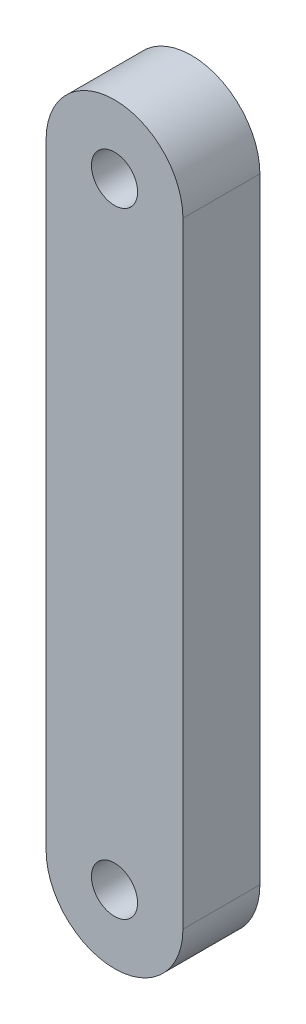
ISO-10303-21;
HEADER;
FILE_DESCRIPTION(('STEP AP214'),'2;1');
FILE_NAME('part.step','',(''),(''),'','','');
FILE_SCHEMA(('AUTOMOTIVE_DESIGN { 1 0 10303 214 1 1 1 1 }'));
ENDSEC;
DATA;
#1=APPLICATION_CONTEXT('core data for automotive mechanical design processes');
#2=APPLICATION_PROTOCOL_DEFINITION('international standard','automotive_design',2000,#1);
#3=PRODUCT_CONTEXT('',#1,'mechanical');
#4=PRODUCT('Part','Part','',(#3));
#5=PRODUCT_RELATED_PRODUCT_CATEGORY('part','',(#4));
#6=PRODUCT_DEFINITION_FORMATION('','',#4);
#7=PRODUCT_DEFINITION_CONTEXT('part definition',#1,'design');
#8=PRODUCT_DEFINITION('design','',#6,#7);
#9=PRODUCT_DEFINITION_SHAPE('','',#8);
#10=(LENGTH_UNIT() NAMED_UNIT(*) SI_UNIT(.MILLI.,.METRE.));
#11=(NAMED_UNIT(*) PLANE_ANGLE_UNIT() SI_UNIT($,.RADIAN.));
#12=(NAMED_UNIT(*) SI_UNIT($,.STERADIAN.) SOLID_ANGLE_UNIT());
#13=UNCERTAINTY_MEASURE_WITH_UNIT(LENGTH_MEASURE(1.E-05),#10,'distance_accuracy_value','');
#14=(GEOMETRIC_REPRESENTATION_CONTEXT(3) GLOBAL_UNCERTAINTY_ASSIGNED_CONTEXT((#13)) GLOBAL_UNIT_ASSIGNED_CONTEXT((#10,
#11,#12)) REPRESENTATION_CONTEXT('',''));
#15=CARTESIAN_POINT('',(0.,0.,0.));
#16=DIRECTION('',(0.,0.,1.));
#17=DIRECTION('',(1.,0.,0.));
#18=AXIS2_PLACEMENT_3D('',#15,#16,#17);
#19=CARTESIAN_POINT('',(0.,-4.00000000000001,1.));
#20=DIRECTION('',(0.,0.,-1.));
#21=DIRECTION('',(-1.,0.,0.));
#22=AXIS2_PLACEMENT_3D('',#19,#20,#21);
#23=CYLINDRICAL_SURFACE('',#22,0.888888888888888);
#24=CARTESIAN_POINT('',(0.,-4.00000000000001,0.));
#25=DIRECTION('',(0.,0.,1.));
#26=DIRECTION('',(1.,0.,0.));
#27=AXIS2_PLACEMENT_3D('',#24,#25,#26);
#28=CIRCLE('',#27,0.888888888888888);
#29=CARTESIAN_POINT('',(-0.888888888888889,-4.00000000000001,0.));
#30=VERTEX_POINT('',#29);
#31=CARTESIAN_POINT('',(0.888888888888889,-4.00000000000001,0.));
#32=VERTEX_POINT('',#31);
#33=EDGE_CURVE('E109',#30,#32,#28,.T.);
#34=ORIENTED_EDGE('',*,*,#33,.T.);
#35=DIRECTION('',(0.,0.,-1.));
#36=VECTOR('',#35,1.);
#37=CARTESIAN_POINT('',(0.888888888888889,-4.00000000000001,1.));
#38=LINE('',#37,#36);
#39=CARTESIAN_POINT('',(0.888888888888889,-4.00000000000001,1.));
#40=VERTEX_POINT('',#39);
#41=EDGE_CURVE('E11',#40,#32,#38,.T.);
#42=ORIENTED_EDGE('',*,*,#41,.F.);
#43=CARTESIAN_POINT('',(0.,-4.00000000000001,1.));
#44=DIRECTION('',(0.,0.,1.));
#45=DIRECTION('',(1.,0.,0.));
#46=AXIS2_PLACEMENT_3D('',#43,#44,#45);
#47=CIRCLE('',#46,0.888888888888888);
#48=CARTESIAN_POINT('',(-0.888888888888889,-4.00000000000001,1.));
#49=VERTEX_POINT('',#48);
#50=EDGE_CURVE('E80',#49,#40,#47,.T.);
#51=ORIENTED_EDGE('',*,*,#50,.F.);
#52=DIRECTION('',(0.,0.,-1.));
#53=VECTOR('',#52,1.);
#54=CARTESIAN_POINT('',(-0.888888888888889,-4.00000000000001,1.));
#55=LINE('',#54,#53);
#56=EDGE_CURVE('E108',#49,#30,#55,.T.);
#57=ORIENTED_EDGE('',*,*,#56,.T.);
#58=EDGE_LOOP('',(#34,#42,#51,#57));
#59=FACE_BOUND('',#58,.T.);
#60=ADVANCED_FACE('F38',(#59),#23,.T.);
#61=CARTESIAN_POINT('',(0.888888888888889,0.,1.));
#62=DIRECTION('',(1.,0.,0.));
#63=DIRECTION('',(0.,1.,0.));
#64=AXIS2_PLACEMENT_3D('',#61,#62,#63);
#65=PLANE('',#64);
#66=DIRECTION('',(0.,-1.,0.));
#67=VECTOR('',#66,1.);
#68=CARTESIAN_POINT('',(0.888888888888889,0.,0.));
#69=LINE('',#68,#67);
#70=CARTESIAN_POINT('',(0.888888888888888,3.99999999999999,0.));
#71=VERTEX_POINT('',#70);
#72=EDGE_CURVE('E90',#71,#32,#69,.T.);
#73=ORIENTED_EDGE('',*,*,#72,.F.);
#74=DIRECTION('',(0.,0.,-1.));
#75=VECTOR('',#74,1.);
#76=CARTESIAN_POINT('',(0.888888888888888,3.99999999999999,1.));
#77=LINE('',#76,#75);
#78=CARTESIAN_POINT('',(0.888888888888888,3.99999999999999,1.));
#79=VERTEX_POINT('',#78);
#80=EDGE_CURVE('E46',#79,#71,#77,.T.);
#81=ORIENTED_EDGE('',*,*,#80,.F.);
#82=DIRECTION('',(0.,-1.,0.));
#83=VECTOR('',#82,1.);
#84=CARTESIAN_POINT('',(0.888888888888889,0.,1.));
#85=LINE('',#84,#83);
#86=EDGE_CURVE('E88',#79,#40,#85,.T.);
#87=ORIENTED_EDGE('',*,*,#86,.T.);
#88=ORIENTED_EDGE('',*,*,#41,.T.);
#89=EDGE_LOOP('',(#73,#81,#87,#88));
#90=FACE_BOUND('',#89,.T.);
#91=ADVANCED_FACE('F87',(#90),#65,.T.);
#92=CARTESIAN_POINT('',(0.,3.99999999999999,1.));
#93=DIRECTION('',(0.,0.,-1.));
#94=DIRECTION('',(-1.,0.,0.));
#95=AXIS2_PLACEMENT_3D('',#92,#93,#94);
#96=CYLINDRICAL_SURFACE('',#95,0.888888888888889);
#97=CARTESIAN_POINT('',(0.,3.99999999999999,0.));
#98=DIRECTION('',(0.,0.,1.));
#99=DIRECTION('',(1.,0.,0.));
#100=AXIS2_PLACEMENT_3D('',#97,#98,#99);
#101=CIRCLE('',#100,0.888888888888889);
#102=CARTESIAN_POINT('',(-0.888888888888888,3.99999999999999,0.));
#103=VERTEX_POINT('',#102);
#104=EDGE_CURVE('E69',#71,#103,#101,.T.);
#105=ORIENTED_EDGE('',*,*,#104,.T.);
#106=DIRECTION('',(0.,0.,-1.));
#107=VECTOR('',#106,1.);
#108=CARTESIAN_POINT('',(-0.888888888888888,3.99999999999999,1.));
#109=LINE('',#108,#107);
#110=CARTESIAN_POINT('',(-0.888888888888888,3.99999999999999,1.));
#111=VERTEX_POINT('',#110);
#112=EDGE_CURVE('E91',#111,#103,#109,.T.);
#113=ORIENTED_EDGE('',*,*,#112,.F.);
#114=CARTESIAN_POINT('',(0.,3.99999999999999,1.));
#115=DIRECTION('',(0.,0.,1.));
#116=DIRECTION('',(1.,0.,0.));
#117=AXIS2_PLACEMENT_3D('',#114,#115,#116);
#118=CIRCLE('',#117,0.888888888888889);
#119=EDGE_CURVE('E92',#79,#111,#118,.T.);
#120=ORIENTED_EDGE('',*,*,#119,.F.);
#121=ORIENTED_EDGE('',*,*,#80,.T.);
#122=EDGE_LOOP('',(#105,#113,#120,#121));
#123=FACE_BOUND('',#122,.T.);
#124=ADVANCED_FACE('F93',(#123),#96,.T.);
#125=CARTESIAN_POINT('',(0.,3.99999999999999,1.));
#126=DIRECTION('',(0.,0.,-1.));
#127=DIRECTION('',(-1.,0.,0.));
#128=AXIS2_PLACEMENT_3D('',#125,#126,#127);
#129=CYLINDRICAL_SURFACE('',#128,0.3);
#130=CARTESIAN_POINT('',(0.,3.99999999999999,1.));
#131=DIRECTION('',(0.,0.,1.));
#132=DIRECTION('',(1.,0.,0.));
#133=AXIS2_PLACEMENT_3D('',#130,#131,#132);
#134=CIRCLE('',#133,0.3);
#135=CARTESIAN_POINT('',(0.300000000000001,3.99999999999999,1.));
#136=VERTEX_POINT('',#135);
#137=EDGE_CURVE('E102',#136,#136,#134,.T.);
#138=ORIENTED_EDGE('',*,*,#137,.T.);
#139=EDGE_LOOP('',(#138));
#140=FACE_BOUND('',#139,.T.);
#141=CARTESIAN_POINT('',(0.,3.99999999999999,0.));
#142=DIRECTION('',(0.,0.,1.));
#143=DIRECTION('',(1.,0.,0.));
#144=AXIS2_PLACEMENT_3D('',#141,#142,#143);
#145=CIRCLE('',#144,0.3);
#146=CARTESIAN_POINT('',(0.300000000000001,3.99999999999999,0.));
#147=VERTEX_POINT('',#146);
#148=EDGE_CURVE('E115',#147,#147,#145,.T.);
#149=ORIENTED_EDGE('',*,*,#148,.F.);
#150=EDGE_LOOP('',(#149));
#151=FACE_BOUND('',#150,.T.);
#152=ADVANCED_FACE('F134',(#140,#151),#129,.F.);
#153=CARTESIAN_POINT('',(-0.888888888888889,0.,1.));
#154=DIRECTION('',(1.,0.,0.));
#155=DIRECTION('',(0.,1.,0.));
#156=AXIS2_PLACEMENT_3D('',#153,#154,#155);
#157=PLANE('',#156);
#158=DIRECTION('',(0.,-1.,0.));
#159=VECTOR('',#158,1.);
#160=CARTESIAN_POINT('',(-0.888888888888889,0.,0.));
#161=LINE('',#160,#159);
#162=EDGE_CURVE('E75',#103,#30,#161,.T.);
#163=ORIENTED_EDGE('',*,*,#162,.T.);
#164=ORIENTED_EDGE('',*,*,#56,.F.);
#165=DIRECTION('',(0.,-1.,0.));
#166=VECTOR('',#165,1.);
#167=CARTESIAN_POINT('',(-0.888888888888889,0.,1.));
#168=LINE('',#167,#166);
#169=EDGE_CURVE('E54',#111,#49,#168,.T.);
#170=ORIENTED_EDGE('',*,*,#169,.F.);
#171=ORIENTED_EDGE('',*,*,#112,.T.);
#172=EDGE_LOOP('',(#163,#164,#170,#171));
#173=FACE_BOUND('',#172,.T.);
#174=ADVANCED_FACE('F121',(#173),#157,.F.);
#175=CARTESIAN_POINT('',(0.,-4.00000000000001,1.));
#176=DIRECTION('',(0.,0.,-1.));
#177=DIRECTION('',(-1.,0.,0.));
#178=AXIS2_PLACEMENT_3D('',#175,#176,#177);
#179=CYLINDRICAL_SURFACE('',#178,0.3);
#180=CARTESIAN_POINT('',(0.,-4.00000000000001,1.));
#181=DIRECTION('',(0.,0.,1.));
#182=DIRECTION('',(1.,0.,0.));
#183=AXIS2_PLACEMENT_3D('',#180,#181,#182);
#184=CIRCLE('',#183,0.3);
#185=CARTESIAN_POINT('',(0.299999999999999,-4.00000000000001,1.));
#186=VERTEX_POINT('',#185);
#187=EDGE_CURVE('E105',#186,#186,#184,.T.);
#188=ORIENTED_EDGE('',*,*,#187,.T.);
#189=EDGE_LOOP('',(#188));
#190=FACE_BOUND('',#189,.T.);
#191=CARTESIAN_POINT('',(0.,-4.00000000000001,0.));
#192=DIRECTION('',(0.,0.,1.));
#193=DIRECTION('',(1.,0.,0.));
#194=AXIS2_PLACEMENT_3D('',#191,#192,#193);
#195=CIRCLE('',#194,0.3);
#196=CARTESIAN_POINT('',(0.299999999999999,-4.00000000000001,0.));
#197=VERTEX_POINT('',#196);
#198=EDGE_CURVE('E98',#197,#197,#195,.T.);
#199=ORIENTED_EDGE('',*,*,#198,.F.);
#200=EDGE_LOOP('',(#199));
#201=FACE_BOUND('',#200,.T.);
#202=ADVANCED_FACE('F139',(#190,#201),#179,.F.);
#203=CARTESIAN_POINT('',(0.,0.,1.));
#204=DIRECTION('',(0.,0.,1.));
#205=DIRECTION('',(1.,0.,0.));
#206=AXIS2_PLACEMENT_3D('',#203,#204,#205);
#207=PLANE('',#206);
#208=ORIENTED_EDGE('',*,*,#50,.T.);
#209=ORIENTED_EDGE('',*,*,#86,.F.);
#210=ORIENTED_EDGE('',*,*,#119,.T.);
#211=ORIENTED_EDGE('',*,*,#169,.T.);
#212=EDGE_LOOP('',(#208,#209,#210,#211));
#213=FACE_BOUND('',#212,.T.);
#214=ORIENTED_EDGE('',*,*,#137,.F.);
#215=EDGE_LOOP('',(#214));
#216=FACE_BOUND('',#215,.T.);
#217=ORIENTED_EDGE('',*,*,#187,.F.);
#218=EDGE_LOOP('',(#217));
#219=FACE_BOUND('',#218,.T.);
#220=ADVANCED_FACE('F95',(#213,#216,#219),#207,.T.);
#221=CARTESIAN_POINT('',(0.,0.,0.));
#222=DIRECTION('',(0.,0.,1.));
#223=DIRECTION('',(1.,0.,0.));
#224=AXIS2_PLACEMENT_3D('',#221,#222,#223);
#225=PLANE('',#224);
#226=ORIENTED_EDGE('',*,*,#33,.F.);
#227=ORIENTED_EDGE('',*,*,#162,.F.);
#228=ORIENTED_EDGE('',*,*,#104,.F.);
#229=ORIENTED_EDGE('',*,*,#72,.T.);
#230=EDGE_LOOP('',(#226,#227,#228,#229));
#231=FACE_BOUND('',#230,.T.);
#232=ORIENTED_EDGE('',*,*,#148,.T.);
#233=EDGE_LOOP('',(#232));
#234=FACE_BOUND('',#233,.T.);
#235=ORIENTED_EDGE('',*,*,#198,.T.);
#236=EDGE_LOOP('',(#235));
#237=FACE_BOUND('',#236,.T.);
#238=ADVANCED_FACE('F124',(#231,#234,#237),#225,.F.);
#239=CLOSED_SHELL('',(#60,#91,#124,#152,#174,#202,#220,#238));
#240=MANIFOLD_SOLID_BREP('B2',#239);
#241=ADVANCED_BREP_SHAPE_REPRESENTATION('',(#18,#240),#14);
#242=SHAPE_DEFINITION_REPRESENTATION(#9,#241);
ENDSEC;
END-ISO-10303-21;
